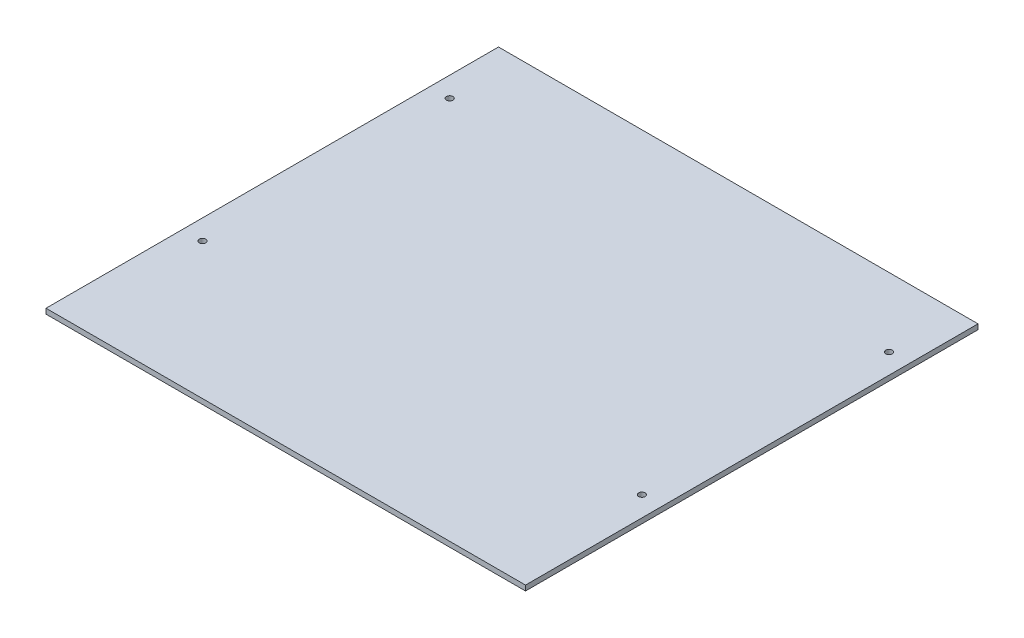
ISO-10303-21;
HEADER;
FILE_DESCRIPTION(('STEP AP214'),'2;1');
FILE_NAME('part.step','',(''),(''),'','','');
FILE_SCHEMA(('AUTOMOTIVE_DESIGN { 1 0 10303 214 1 1 1 1 }'));
ENDSEC;
DATA;
#1=APPLICATION_CONTEXT('core data for automotive mechanical design processes');
#2=APPLICATION_PROTOCOL_DEFINITION('international standard','automotive_design',2000,#1);
#3=PRODUCT_CONTEXT('',#1,'mechanical');
#4=PRODUCT('Part','Part','',(#3));
#5=PRODUCT_RELATED_PRODUCT_CATEGORY('part','',(#4));
#6=PRODUCT_DEFINITION_FORMATION('','',#4);
#7=PRODUCT_DEFINITION_CONTEXT('part definition',#1,'design');
#8=PRODUCT_DEFINITION('design','',#6,#7);
#9=PRODUCT_DEFINITION_SHAPE('','',#8);
#10=(LENGTH_UNIT() NAMED_UNIT(*) SI_UNIT(.MILLI.,.METRE.));
#11=(NAMED_UNIT(*) PLANE_ANGLE_UNIT() SI_UNIT($,.RADIAN.));
#12=(NAMED_UNIT(*) SI_UNIT($,.STERADIAN.) SOLID_ANGLE_UNIT());
#13=UNCERTAINTY_MEASURE_WITH_UNIT(LENGTH_MEASURE(1.E-05),#10,'distance_accuracy_value','');
#14=(GEOMETRIC_REPRESENTATION_CONTEXT(3) GLOBAL_UNCERTAINTY_ASSIGNED_CONTEXT((#13)) GLOBAL_UNIT_ASSIGNED_CONTEXT((#10,
#11,#12)) REPRESENTATION_CONTEXT('',''));
#15=CARTESIAN_POINT('',(0.,0.,0.));
#16=DIRECTION('',(0.,0.,1.));
#17=DIRECTION('',(1.,0.,0.));
#18=AXIS2_PLACEMENT_3D('',#15,#16,#17);
#19=CARTESIAN_POINT('',(0.,3.,0.));
#20=DIRECTION('',(0.,1.,0.));
#21=DIRECTION('',(0.,0.,1.));
#22=AXIS2_PLACEMENT_3D('',#19,#20,#21);
#23=PLANE('',#22);
#24=CARTESIAN_POINT('',(-128.,3.,184.132));
#25=DIRECTION('',(0.,1.,0.));
#26=DIRECTION('',(0.,0.,1.));
#27=AXIS2_PLACEMENT_3D('',#24,#25,#26);
#28=CIRCLE('',#27,1.89229999999999);
#29=CARTESIAN_POINT('',(-128.,3.,186.0243));
#30=VERTEX_POINT('',#29);
#31=EDGE_CURVE('E121',#30,#30,#28,.T.);
#32=ORIENTED_EDGE('',*,*,#31,.F.);
#33=EDGE_LOOP('',(#32));
#34=FACE_BOUND('',#33,.T.);
#35=CARTESIAN_POINT('',(-128.,3.,40.132));
#36=DIRECTION('',(0.,1.,0.));
#37=DIRECTION('',(0.,0.,1.));
#38=AXIS2_PLACEMENT_3D('',#35,#36,#37);
#39=CIRCLE('',#38,1.89230000000002);
#40=CARTESIAN_POINT('',(-128.,3.,42.0243));
#41=VERTEX_POINT('',#40);
#42=EDGE_CURVE('E100',#41,#41,#39,.T.);
#43=ORIENTED_EDGE('',*,*,#42,.F.);
#44=EDGE_LOOP('',(#43));
#45=FACE_BOUND('',#44,.T.);
#46=DIRECTION('',(0.,0.,1.));
#47=VECTOR('',#46,1.);
#48=CARTESIAN_POINT('',(-139.7,3.,0.));
#49=LINE('',#48,#47);
#50=CARTESIAN_POINT('',(-139.7,3.,0.));
#51=VERTEX_POINT('',#50);
#52=CARTESIAN_POINT('',(-139.7,3.,263.652));
#53=VERTEX_POINT('',#52);
#54=EDGE_CURVE('E85',#51,#53,#49,.T.);
#55=ORIENTED_EDGE('',*,*,#54,.T.);
#56=DIRECTION('',(1.,0.,0.));
#57=VECTOR('',#56,1.);
#58=CARTESIAN_POINT('',(-139.7,3.,263.652));
#59=LINE('',#58,#57);
#60=CARTESIAN_POINT('',(139.7,3.,263.652));
#61=VERTEX_POINT('',#60);
#62=EDGE_CURVE('E80',#53,#61,#59,.T.);
#63=ORIENTED_EDGE('',*,*,#62,.T.);
#64=DIRECTION('',(0.,0.,-1.));
#65=VECTOR('',#64,1.);
#66=CARTESIAN_POINT('',(139.7,3.,0.));
#67=LINE('',#66,#65);
#68=CARTESIAN_POINT('',(139.7,3.,0.));
#69=VERTEX_POINT('',#68);
#70=EDGE_CURVE('E83',#61,#69,#67,.T.);
#71=ORIENTED_EDGE('',*,*,#70,.T.);
#72=DIRECTION('',(-1.,0.,0.));
#73=VECTOR('',#72,1.);
#74=CARTESIAN_POINT('',(-139.7,3.,0.));
#75=LINE('',#74,#73);
#76=EDGE_CURVE('E50',#69,#51,#75,.T.);
#77=ORIENTED_EDGE('',*,*,#76,.T.);
#78=EDGE_LOOP('',(#55,#63,#71,#77));
#79=FACE_BOUND('',#78,.T.);
#80=CARTESIAN_POINT('',(128.,3.,40.132));
#81=DIRECTION('',(0.,1.,0.));
#82=DIRECTION('',(0.,0.,1.));
#83=AXIS2_PLACEMENT_3D('',#80,#81,#82);
#84=CIRCLE('',#83,1.89230000000002);
#85=CARTESIAN_POINT('',(128.,3.,42.0243));
#86=VERTEX_POINT('',#85);
#87=EDGE_CURVE('E115',#86,#86,#84,.T.);
#88=ORIENTED_EDGE('',*,*,#87,.F.);
#89=EDGE_LOOP('',(#88));
#90=FACE_BOUND('',#89,.T.);
#91=CARTESIAN_POINT('',(128.,3.,184.132));
#92=DIRECTION('',(0.,1.,0.));
#93=DIRECTION('',(0.,0.,1.));
#94=AXIS2_PLACEMENT_3D('',#91,#92,#93);
#95=CIRCLE('',#94,1.89229999999999);
#96=CARTESIAN_POINT('',(128.,3.,186.0243));
#97=VERTEX_POINT('',#96);
#98=EDGE_CURVE('E127',#97,#97,#95,.T.);
#99=ORIENTED_EDGE('',*,*,#98,.F.);
#100=EDGE_LOOP('',(#99));
#101=FACE_BOUND('',#100,.T.);
#102=ADVANCED_FACE('F33',(#34,#45,#79,#90,#101),#23,.T.);
#103=CARTESIAN_POINT('',(0.,0.,0.));
#104=DIRECTION('',(0.,1.,0.));
#105=DIRECTION('',(0.,0.,1.));
#106=AXIS2_PLACEMENT_3D('',#103,#104,#105);
#107=PLANE('',#106);
#108=DIRECTION('',(0.,0.,1.));
#109=VECTOR('',#108,1.);
#110=CARTESIAN_POINT('',(-139.7,0.,0.));
#111=LINE('',#110,#109);
#112=CARTESIAN_POINT('',(-139.7,0.,0.));
#113=VERTEX_POINT('',#112);
#114=CARTESIAN_POINT('',(-139.7,0.,263.652));
#115=VERTEX_POINT('',#114);
#116=EDGE_CURVE('E97',#113,#115,#111,.T.);
#117=ORIENTED_EDGE('',*,*,#116,.F.);
#118=DIRECTION('',(-1.,0.,0.));
#119=VECTOR('',#118,1.);
#120=CARTESIAN_POINT('',(-139.7,0.,0.));
#121=LINE('',#120,#119);
#122=CARTESIAN_POINT('',(139.7,0.,0.));
#123=VERTEX_POINT('',#122);
#124=EDGE_CURVE('E73',#123,#113,#121,.T.);
#125=ORIENTED_EDGE('',*,*,#124,.F.);
#126=DIRECTION('',(0.,0.,-1.));
#127=VECTOR('',#126,1.);
#128=CARTESIAN_POINT('',(139.7,0.,0.));
#129=LINE('',#128,#127);
#130=CARTESIAN_POINT('',(139.7,0.,263.652));
#131=VERTEX_POINT('',#130);
#132=EDGE_CURVE('E67',#131,#123,#129,.T.);
#133=ORIENTED_EDGE('',*,*,#132,.F.);
#134=DIRECTION('',(1.,0.,0.));
#135=VECTOR('',#134,1.);
#136=CARTESIAN_POINT('',(-139.7,0.,263.652));
#137=LINE('',#136,#135);
#138=EDGE_CURVE('E89',#115,#131,#137,.T.);
#139=ORIENTED_EDGE('',*,*,#138,.F.);
#140=EDGE_LOOP('',(#117,#125,#133,#139));
#141=FACE_BOUND('',#140,.T.);
#142=CARTESIAN_POINT('',(-128.,0.,40.132));
#143=DIRECTION('',(0.,1.,0.));
#144=DIRECTION('',(0.,0.,1.));
#145=AXIS2_PLACEMENT_3D('',#142,#143,#144);
#146=CIRCLE('',#145,1.89230000000002);
#147=CARTESIAN_POINT('',(-128.,0.,42.0243));
#148=VERTEX_POINT('',#147);
#149=EDGE_CURVE('E112',#148,#148,#146,.T.);
#150=ORIENTED_EDGE('',*,*,#149,.T.);
#151=EDGE_LOOP('',(#150));
#152=FACE_BOUND('',#151,.T.);
#153=CARTESIAN_POINT('',(128.,0.,40.132));
#154=DIRECTION('',(0.,1.,0.));
#155=DIRECTION('',(0.,0.,1.));
#156=AXIS2_PLACEMENT_3D('',#153,#154,#155);
#157=CIRCLE('',#156,1.89230000000002);
#158=CARTESIAN_POINT('',(128.,0.,42.0243));
#159=VERTEX_POINT('',#158);
#160=EDGE_CURVE('E118',#159,#159,#157,.T.);
#161=ORIENTED_EDGE('',*,*,#160,.T.);
#162=EDGE_LOOP('',(#161));
#163=FACE_BOUND('',#162,.T.);
#164=CARTESIAN_POINT('',(-128.,0.,184.132));
#165=DIRECTION('',(0.,1.,0.));
#166=DIRECTION('',(0.,0.,1.));
#167=AXIS2_PLACEMENT_3D('',#164,#165,#166);
#168=CIRCLE('',#167,1.89229999999999);
#169=CARTESIAN_POINT('',(-128.,0.,186.0243));
#170=VERTEX_POINT('',#169);
#171=EDGE_CURVE('E124',#170,#170,#168,.T.);
#172=ORIENTED_EDGE('',*,*,#171,.T.);
#173=EDGE_LOOP('',(#172));
#174=FACE_BOUND('',#173,.T.);
#175=CARTESIAN_POINT('',(128.,0.,184.132));
#176=DIRECTION('',(0.,1.,0.));
#177=DIRECTION('',(0.,0.,1.));
#178=AXIS2_PLACEMENT_3D('',#175,#176,#177);
#179=CIRCLE('',#178,1.89229999999999);
#180=CARTESIAN_POINT('',(128.,0.,186.0243));
#181=VERTEX_POINT('',#180);
#182=EDGE_CURVE('E130',#181,#181,#179,.T.);
#183=ORIENTED_EDGE('',*,*,#182,.T.);
#184=EDGE_LOOP('',(#183));
#185=FACE_BOUND('',#184,.T.);
#186=ADVANCED_FACE('F108',(#141,#152,#163,#174,#185),#107,.F.);
#187=CARTESIAN_POINT('',(-139.7,3.,0.));
#188=DIRECTION('',(1.,0.,0.));
#189=DIRECTION('',(0.,0.,-1.));
#190=AXIS2_PLACEMENT_3D('',#187,#188,#189);
#191=PLANE('',#190);
#192=ORIENTED_EDGE('',*,*,#116,.T.);
#193=DIRECTION('',(0.,-1.,0.));
#194=VECTOR('',#193,1.);
#195=CARTESIAN_POINT('',(-139.7,3.,263.652));
#196=LINE('',#195,#194);
#197=EDGE_CURVE('E11',#53,#115,#196,.T.);
#198=ORIENTED_EDGE('',*,*,#197,.F.);
#199=ORIENTED_EDGE('',*,*,#54,.F.);
#200=DIRECTION('',(0.,-1.,0.));
#201=VECTOR('',#200,1.);
#202=CARTESIAN_POINT('',(-139.7,3.,0.));
#203=LINE('',#202,#201);
#204=EDGE_CURVE('E93',#51,#113,#203,.T.);
#205=ORIENTED_EDGE('',*,*,#204,.T.);
#206=EDGE_LOOP('',(#192,#198,#199,#205));
#207=FACE_BOUND('',#206,.T.);
#208=ADVANCED_FACE('F35',(#207),#191,.F.);
#209=CARTESIAN_POINT('',(-139.7,3.,263.652));
#210=DIRECTION('',(0.,0.,-1.));
#211=DIRECTION('',(-1.,0.,0.));
#212=AXIS2_PLACEMENT_3D('',#209,#210,#211);
#213=PLANE('',#212);
#214=ORIENTED_EDGE('',*,*,#138,.T.);
#215=DIRECTION('',(0.,-1.,0.));
#216=VECTOR('',#215,1.);
#217=CARTESIAN_POINT('',(139.7,3.,263.652));
#218=LINE('',#217,#216);
#219=EDGE_CURVE('E42',#61,#131,#218,.T.);
#220=ORIENTED_EDGE('',*,*,#219,.F.);
#221=ORIENTED_EDGE('',*,*,#62,.F.);
#222=ORIENTED_EDGE('',*,*,#197,.T.);
#223=EDGE_LOOP('',(#214,#220,#221,#222));
#224=FACE_BOUND('',#223,.T.);
#225=ADVANCED_FACE('F88',(#224),#213,.F.);
#226=CARTESIAN_POINT('',(139.7,3.,0.));
#227=DIRECTION('',(-1.,0.,0.));
#228=DIRECTION('',(0.,0.,1.));
#229=AXIS2_PLACEMENT_3D('',#226,#227,#228);
#230=PLANE('',#229);
#231=ORIENTED_EDGE('',*,*,#132,.T.);
#232=DIRECTION('',(0.,-1.,0.));
#233=VECTOR('',#232,1.);
#234=CARTESIAN_POINT('',(139.7,3.,0.));
#235=LINE('',#234,#233);
#236=EDGE_CURVE('E90',#69,#123,#235,.T.);
#237=ORIENTED_EDGE('',*,*,#236,.F.);
#238=ORIENTED_EDGE('',*,*,#70,.F.);
#239=ORIENTED_EDGE('',*,*,#219,.T.);
#240=EDGE_LOOP('',(#231,#237,#238,#239));
#241=FACE_BOUND('',#240,.T.);
#242=ADVANCED_FACE('F91',(#241),#230,.F.);
#243=CARTESIAN_POINT('',(-139.7,3.,0.));
#244=DIRECTION('',(0.,0.,1.));
#245=DIRECTION('',(1.,0.,0.));
#246=AXIS2_PLACEMENT_3D('',#243,#244,#245);
#247=PLANE('',#246);
#248=ORIENTED_EDGE('',*,*,#124,.T.);
#249=ORIENTED_EDGE('',*,*,#204,.F.);
#250=ORIENTED_EDGE('',*,*,#76,.F.);
#251=ORIENTED_EDGE('',*,*,#236,.T.);
#252=EDGE_LOOP('',(#248,#249,#250,#251));
#253=FACE_BOUND('',#252,.T.);
#254=ADVANCED_FACE('F105',(#253),#247,.F.);
#255=CARTESIAN_POINT('',(-128.,3.,40.132));
#256=DIRECTION('',(0.,-1.,0.));
#257=DIRECTION('',(0.,0.,-1.));
#258=AXIS2_PLACEMENT_3D('',#255,#256,#257);
#259=CYLINDRICAL_SURFACE('',#258,1.89230000000002);
#260=ORIENTED_EDGE('',*,*,#42,.T.);
#261=EDGE_LOOP('',(#260));
#262=FACE_BOUND('',#261,.T.);
#263=ORIENTED_EDGE('',*,*,#149,.F.);
#264=EDGE_LOOP('',(#263));
#265=FACE_BOUND('',#264,.T.);
#266=ADVANCED_FACE('F149',(#262,#265),#259,.F.);
#267=CARTESIAN_POINT('',(128.,3.,40.132));
#268=DIRECTION('',(0.,-1.,0.));
#269=DIRECTION('',(0.,0.,-1.));
#270=AXIS2_PLACEMENT_3D('',#267,#268,#269);
#271=CYLINDRICAL_SURFACE('',#270,1.89230000000002);
#272=ORIENTED_EDGE('',*,*,#87,.T.);
#273=EDGE_LOOP('',(#272));
#274=FACE_BOUND('',#273,.T.);
#275=ORIENTED_EDGE('',*,*,#160,.F.);
#276=EDGE_LOOP('',(#275));
#277=FACE_BOUND('',#276,.T.);
#278=ADVANCED_FACE('F195',(#274,#277),#271,.F.);
#279=CARTESIAN_POINT('',(-128.,3.,184.132));
#280=DIRECTION('',(0.,-1.,0.));
#281=DIRECTION('',(0.,0.,-1.));
#282=AXIS2_PLACEMENT_3D('',#279,#280,#281);
#283=CYLINDRICAL_SURFACE('',#282,1.89229999999999);
#284=ORIENTED_EDGE('',*,*,#31,.T.);
#285=EDGE_LOOP('',(#284));
#286=FACE_BOUND('',#285,.T.);
#287=ORIENTED_EDGE('',*,*,#171,.F.);
#288=EDGE_LOOP('',(#287));
#289=FACE_BOUND('',#288,.T.);
#290=ADVANCED_FACE('F203',(#286,#289),#283,.F.);
#291=CARTESIAN_POINT('',(128.,3.,184.132));
#292=DIRECTION('',(0.,-1.,0.));
#293=DIRECTION('',(0.,0.,-1.));
#294=AXIS2_PLACEMENT_3D('',#291,#292,#293);
#295=CYLINDRICAL_SURFACE('',#294,1.89229999999999);
#296=ORIENTED_EDGE('',*,*,#98,.T.);
#297=EDGE_LOOP('',(#296));
#298=FACE_BOUND('',#297,.T.);
#299=ORIENTED_EDGE('',*,*,#182,.F.);
#300=EDGE_LOOP('',(#299));
#301=FACE_BOUND('',#300,.T.);
#302=ADVANCED_FACE('F136',(#298,#301),#295,.F.);
#303=CLOSED_SHELL('',(#102,#186,#208,#225,#242,#254,#266,#278,#290,#302));
#304=MANIFOLD_SOLID_BREP('B2',#303);
#305=ADVANCED_BREP_SHAPE_REPRESENTATION('',(#18,#304),#14);
#306=SHAPE_DEFINITION_REPRESENTATION(#9,#305);
ENDSEC;
END-ISO-10303-21;
